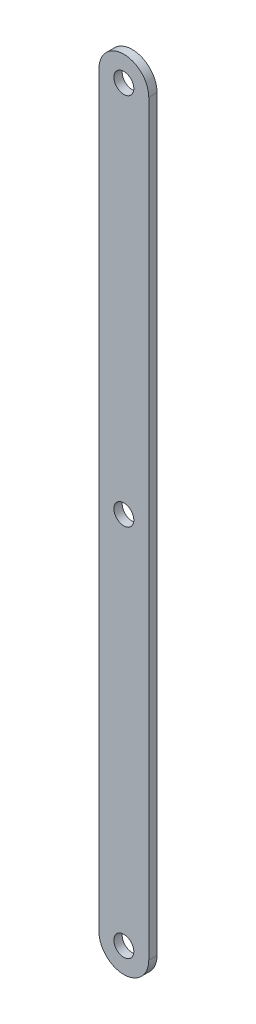
ISO-10303-21;
HEADER;
FILE_DESCRIPTION(('STEP AP214'),'2;1');
FILE_NAME('part.step','',(''),(''),'','','');
FILE_SCHEMA(('AUTOMOTIVE_DESIGN { 1 0 10303 214 1 1 1 1 }'));
ENDSEC;
DATA;
#1=APPLICATION_CONTEXT('core data for automotive mechanical design processes');
#2=APPLICATION_PROTOCOL_DEFINITION('international standard','automotive_design',2000,#1);
#3=PRODUCT_CONTEXT('',#1,'mechanical');
#4=PRODUCT('Part','Part','',(#3));
#5=PRODUCT_RELATED_PRODUCT_CATEGORY('part','',(#4));
#6=PRODUCT_DEFINITION_FORMATION('','',#4);
#7=PRODUCT_DEFINITION_CONTEXT('part definition',#1,'design');
#8=PRODUCT_DEFINITION('design','',#6,#7);
#9=PRODUCT_DEFINITION_SHAPE('','',#8);
#10=(LENGTH_UNIT() NAMED_UNIT(*) SI_UNIT(.MILLI.,.METRE.));
#11=(NAMED_UNIT(*) PLANE_ANGLE_UNIT() SI_UNIT($,.RADIAN.));
#12=(NAMED_UNIT(*) SI_UNIT($,.STERADIAN.) SOLID_ANGLE_UNIT());
#13=UNCERTAINTY_MEASURE_WITH_UNIT(LENGTH_MEASURE(1.E-05),#10,'distance_accuracy_value','');
#14=(GEOMETRIC_REPRESENTATION_CONTEXT(3) GLOBAL_UNCERTAINTY_ASSIGNED_CONTEXT((#13)) GLOBAL_UNIT_ASSIGNED_CONTEXT((#10,
#11,#12)) REPRESENTATION_CONTEXT('',''));
#15=CARTESIAN_POINT('',(0.,0.,0.));
#16=DIRECTION('',(0.,0.,1.));
#17=DIRECTION('',(1.,0.,0.));
#18=AXIS2_PLACEMENT_3D('',#15,#16,#17);
#19=CARTESIAN_POINT('',(23.3631138751007,62.6957680311895,5.));
#20=DIRECTION('',(0.,0.,1.));
#21=DIRECTION('',(1.,0.,0.));
#22=AXIS2_PLACEMENT_3D('',#19,#20,#21);
#23=PLANE('',#22);
#24=CARTESIAN_POINT('',(23.3631138751007,62.6957680311895,5.));
#25=DIRECTION('',(0.,0.,1.));
#26=DIRECTION('',(1.,0.,0.));
#27=AXIS2_PLACEMENT_3D('',#24,#25,#26);
#28=CIRCLE('',#27,6.);
#29=CARTESIAN_POINT('',(29.3631138751007,62.6957680311895,5.));
#30=VERTEX_POINT('',#29);
#31=EDGE_CURVE('E115',#30,#30,#28,.T.);
#32=ORIENTED_EDGE('',*,*,#31,.F.);
#33=EDGE_LOOP('',(#32));
#34=FACE_BOUND('',#33,.T.);
#35=CARTESIAN_POINT('',(23.3631138751007,62.6957680311895,5.));
#36=DIRECTION('',(0.,0.,1.));
#37=DIRECTION('',(1.,0.,0.));
#38=AXIS2_PLACEMENT_3D('',#35,#36,#37);
#39=CIRCLE('',#38,15.);
#40=CARTESIAN_POINT('',(8.36311387510069,62.6957680311895,5.));
#41=VERTEX_POINT('',#40);
#42=CARTESIAN_POINT('',(38.3631138751007,62.6957680311895,5.));
#43=VERTEX_POINT('',#42);
#44=EDGE_CURVE('E85',#41,#43,#39,.T.);
#45=ORIENTED_EDGE('',*,*,#44,.T.);
#46=DIRECTION('',(0.,1.,0.));
#47=VECTOR('',#46,1.);
#48=CARTESIAN_POINT('',(38.3631138751007,512.69576803119,5.));
#49=LINE('',#48,#47);
#50=CARTESIAN_POINT('',(38.3631138751007,512.69576803119,5.));
#51=VERTEX_POINT('',#50);
#52=EDGE_CURVE('E80',#43,#51,#49,.T.);
#53=ORIENTED_EDGE('',*,*,#52,.T.);
#54=CARTESIAN_POINT('',(23.3631138751007,512.69576803119,5.));
#55=DIRECTION('',(0.,0.,1.));
#56=DIRECTION('',(1.,0.,0.));
#57=AXIS2_PLACEMENT_3D('',#54,#55,#56);
#58=CIRCLE('',#57,15.);
#59=CARTESIAN_POINT('',(8.36311387510069,512.69576803119,5.));
#60=VERTEX_POINT('',#59);
#61=EDGE_CURVE('E83',#51,#60,#58,.T.);
#62=ORIENTED_EDGE('',*,*,#61,.T.);
#63=DIRECTION('',(0.,-1.,0.));
#64=VECTOR('',#63,1.);
#65=CARTESIAN_POINT('',(8.36311387510069,62.6957680311895,5.));
#66=LINE('',#65,#64);
#67=EDGE_CURVE('E50',#60,#41,#66,.T.);
#68=ORIENTED_EDGE('',*,*,#67,.T.);
#69=EDGE_LOOP('',(#45,#53,#62,#68));
#70=FACE_BOUND('',#69,.T.);
#71=CARTESIAN_POINT('',(23.3631138751007,512.69576803119,5.));
#72=DIRECTION('',(0.,0.,1.));
#73=DIRECTION('',(1.,0.,0.));
#74=AXIS2_PLACEMENT_3D('',#71,#72,#73);
#75=CIRCLE('',#74,6.);
#76=CARTESIAN_POINT('',(29.3631138751007,512.69576803119,5.));
#77=VERTEX_POINT('',#76);
#78=EDGE_CURVE('E100',#77,#77,#75,.T.);
#79=ORIENTED_EDGE('',*,*,#78,.F.);
#80=EDGE_LOOP('',(#79));
#81=FACE_BOUND('',#80,.T.);
#82=CARTESIAN_POINT('',(23.3631138751007,287.69576803119,5.));
#83=DIRECTION('',(0.,0.,1.));
#84=DIRECTION('',(1.,0.,0.));
#85=AXIS2_PLACEMENT_3D('',#82,#83,#84);
#86=CIRCLE('',#85,6.);
#87=CARTESIAN_POINT('',(29.3631138751007,287.69576803119,5.));
#88=VERTEX_POINT('',#87);
#89=EDGE_CURVE('E121',#88,#88,#86,.T.);
#90=ORIENTED_EDGE('',*,*,#89,.F.);
#91=EDGE_LOOP('',(#90));
#92=FACE_BOUND('',#91,.T.);
#93=ADVANCED_FACE('F33',(#34,#70,#81,#92),#23,.T.);
#94=CARTESIAN_POINT('',(23.3631138751007,62.6957680311895,0.));
#95=DIRECTION('',(0.,0.,1.));
#96=DIRECTION('',(1.,0.,0.));
#97=AXIS2_PLACEMENT_3D('',#94,#95,#96);
#98=PLANE('',#97);
#99=CARTESIAN_POINT('',(23.3631138751007,62.6957680311895,0.));
#100=DIRECTION('',(0.,0.,1.));
#101=DIRECTION('',(1.,0.,0.));
#102=AXIS2_PLACEMENT_3D('',#99,#100,#101);
#103=CIRCLE('',#102,15.);
#104=CARTESIAN_POINT('',(8.36311387510069,62.6957680311895,0.));
#105=VERTEX_POINT('',#104);
#106=CARTESIAN_POINT('',(38.3631138751007,62.6957680311895,0.));
#107=VERTEX_POINT('',#106);
#108=EDGE_CURVE('E97',#105,#107,#103,.T.);
#109=ORIENTED_EDGE('',*,*,#108,.F.);
#110=DIRECTION('',(0.,-1.,0.));
#111=VECTOR('',#110,1.);
#112=CARTESIAN_POINT('',(8.36311387510069,62.6957680311895,0.));
#113=LINE('',#112,#111);
#114=CARTESIAN_POINT('',(8.36311387510069,512.69576803119,0.));
#115=VERTEX_POINT('',#114);
#116=EDGE_CURVE('E73',#115,#105,#113,.T.);
#117=ORIENTED_EDGE('',*,*,#116,.F.);
#118=CARTESIAN_POINT('',(23.3631138751007,512.69576803119,0.));
#119=DIRECTION('',(0.,0.,1.));
#120=DIRECTION('',(1.,0.,0.));
#121=AXIS2_PLACEMENT_3D('',#118,#119,#120);
#122=CIRCLE('',#121,15.);
#123=CARTESIAN_POINT('',(38.3631138751007,512.69576803119,0.));
#124=VERTEX_POINT('',#123);
#125=EDGE_CURVE('E67',#124,#115,#122,.T.);
#126=ORIENTED_EDGE('',*,*,#125,.F.);
#127=DIRECTION('',(0.,1.,0.));
#128=VECTOR('',#127,1.);
#129=CARTESIAN_POINT('',(38.3631138751007,512.69576803119,0.));
#130=LINE('',#129,#128);
#131=EDGE_CURVE('E89',#107,#124,#130,.T.);
#132=ORIENTED_EDGE('',*,*,#131,.F.);
#133=EDGE_LOOP('',(#109,#117,#126,#132));
#134=FACE_BOUND('',#133,.T.);
#135=CARTESIAN_POINT('',(23.3631138751007,512.69576803119,0.));
#136=DIRECTION('',(0.,0.,1.));
#137=DIRECTION('',(1.,0.,0.));
#138=AXIS2_PLACEMENT_3D('',#135,#136,#137);
#139=CIRCLE('',#138,6.);
#140=CARTESIAN_POINT('',(29.3631138751007,512.69576803119,0.));
#141=VERTEX_POINT('',#140);
#142=EDGE_CURVE('E112',#141,#141,#139,.T.);
#143=ORIENTED_EDGE('',*,*,#142,.T.);
#144=EDGE_LOOP('',(#143));
#145=FACE_BOUND('',#144,.T.);
#146=CARTESIAN_POINT('',(23.3631138751007,62.6957680311895,0.));
#147=DIRECTION('',(0.,0.,1.));
#148=DIRECTION('',(1.,0.,0.));
#149=AXIS2_PLACEMENT_3D('',#146,#147,#148);
#150=CIRCLE('',#149,6.);
#151=CARTESIAN_POINT('',(29.3631138751007,62.6957680311895,0.));
#152=VERTEX_POINT('',#151);
#153=EDGE_CURVE('E118',#152,#152,#150,.T.);
#154=ORIENTED_EDGE('',*,*,#153,.T.);
#155=EDGE_LOOP('',(#154));
#156=FACE_BOUND('',#155,.T.);
#157=CARTESIAN_POINT('',(23.3631138751007,287.69576803119,0.));
#158=DIRECTION('',(0.,0.,1.));
#159=DIRECTION('',(1.,0.,0.));
#160=AXIS2_PLACEMENT_3D('',#157,#158,#159);
#161=CIRCLE('',#160,6.);
#162=CARTESIAN_POINT('',(29.3631138751007,287.69576803119,0.));
#163=VERTEX_POINT('',#162);
#164=EDGE_CURVE('E124',#163,#163,#161,.T.);
#165=ORIENTED_EDGE('',*,*,#164,.T.);
#166=EDGE_LOOP('',(#165));
#167=FACE_BOUND('',#166,.T.);
#168=ADVANCED_FACE('F108',(#134,#145,#156,#167),#98,.F.);
#169=CARTESIAN_POINT('',(23.3631138751007,62.6957680311895,5.));
#170=DIRECTION('',(0.,0.,-1.));
#171=DIRECTION('',(-1.,0.,0.));
#172=AXIS2_PLACEMENT_3D('',#169,#170,#171);
#173=CYLINDRICAL_SURFACE('',#172,15.);
#174=ORIENTED_EDGE('',*,*,#108,.T.);
#175=DIRECTION('',(0.,0.,-1.));
#176=VECTOR('',#175,1.);
#177=CARTESIAN_POINT('',(38.3631138751007,62.6957680311895,5.));
#178=LINE('',#177,#176);
#179=EDGE_CURVE('E11',#43,#107,#178,.T.);
#180=ORIENTED_EDGE('',*,*,#179,.F.);
#181=ORIENTED_EDGE('',*,*,#44,.F.);
#182=DIRECTION('',(0.,0.,-1.));
#183=VECTOR('',#182,1.);
#184=CARTESIAN_POINT('',(8.36311387510069,62.6957680311895,5.));
#185=LINE('',#184,#183);
#186=EDGE_CURVE('E93',#41,#105,#185,.T.);
#187=ORIENTED_EDGE('',*,*,#186,.T.);
#188=EDGE_LOOP('',(#174,#180,#181,#187));
#189=FACE_BOUND('',#188,.T.);
#190=ADVANCED_FACE('F35',(#189),#173,.T.);
#191=CARTESIAN_POINT('',(38.3631138751007,512.69576803119,5.));
#192=DIRECTION('',(-1.,0.,0.));
#193=DIRECTION('',(0.,-1.,0.));
#194=AXIS2_PLACEMENT_3D('',#191,#192,#193);
#195=PLANE('',#194);
#196=ORIENTED_EDGE('',*,*,#131,.T.);
#197=DIRECTION('',(0.,0.,-1.));
#198=VECTOR('',#197,1.);
#199=CARTESIAN_POINT('',(38.3631138751007,512.69576803119,5.));
#200=LINE('',#199,#198);
#201=EDGE_CURVE('E42',#51,#124,#200,.T.);
#202=ORIENTED_EDGE('',*,*,#201,.F.);
#203=ORIENTED_EDGE('',*,*,#52,.F.);
#204=ORIENTED_EDGE('',*,*,#179,.T.);
#205=EDGE_LOOP('',(#196,#202,#203,#204));
#206=FACE_BOUND('',#205,.T.);
#207=ADVANCED_FACE('F88',(#206),#195,.F.);
#208=CARTESIAN_POINT('',(23.3631138751007,512.69576803119,5.));
#209=DIRECTION('',(0.,0.,-1.));
#210=DIRECTION('',(-1.,0.,0.));
#211=AXIS2_PLACEMENT_3D('',#208,#209,#210);
#212=CYLINDRICAL_SURFACE('',#211,15.);
#213=ORIENTED_EDGE('',*,*,#125,.T.);
#214=DIRECTION('',(0.,0.,-1.));
#215=VECTOR('',#214,1.);
#216=CARTESIAN_POINT('',(8.36311387510069,512.69576803119,5.));
#217=LINE('',#216,#215);
#218=EDGE_CURVE('E90',#60,#115,#217,.T.);
#219=ORIENTED_EDGE('',*,*,#218,.F.);
#220=ORIENTED_EDGE('',*,*,#61,.F.);
#221=ORIENTED_EDGE('',*,*,#201,.T.);
#222=EDGE_LOOP('',(#213,#219,#220,#221));
#223=FACE_BOUND('',#222,.T.);
#224=ADVANCED_FACE('F91',(#223),#212,.T.);
#225=CARTESIAN_POINT('',(8.36311387510069,62.6957680311895,5.));
#226=DIRECTION('',(1.,0.,0.));
#227=DIRECTION('',(0.,0.,-1.));
#228=AXIS2_PLACEMENT_3D('',#225,#226,#227);
#229=PLANE('',#228);
#230=ORIENTED_EDGE('',*,*,#116,.T.);
#231=ORIENTED_EDGE('',*,*,#186,.F.);
#232=ORIENTED_EDGE('',*,*,#67,.F.);
#233=ORIENTED_EDGE('',*,*,#218,.T.);
#234=EDGE_LOOP('',(#230,#231,#232,#233));
#235=FACE_BOUND('',#234,.T.);
#236=ADVANCED_FACE('F105',(#235),#229,.F.);
#237=CARTESIAN_POINT('',(23.3631138751007,512.69576803119,5.));
#238=DIRECTION('',(0.,0.,-1.));
#239=DIRECTION('',(-1.,0.,0.));
#240=AXIS2_PLACEMENT_3D('',#237,#238,#239);
#241=CYLINDRICAL_SURFACE('',#240,6.);
#242=ORIENTED_EDGE('',*,*,#78,.T.);
#243=EDGE_LOOP('',(#242));
#244=FACE_BOUND('',#243,.T.);
#245=ORIENTED_EDGE('',*,*,#142,.F.);
#246=EDGE_LOOP('',(#245));
#247=FACE_BOUND('',#246,.T.);
#248=ADVANCED_FACE('F142',(#244,#247),#241,.F.);
#249=CARTESIAN_POINT('',(23.3631138751007,62.6957680311895,5.));
#250=DIRECTION('',(0.,0.,-1.));
#251=DIRECTION('',(-1.,0.,0.));
#252=AXIS2_PLACEMENT_3D('',#249,#250,#251);
#253=CYLINDRICAL_SURFACE('',#252,6.);
#254=ORIENTED_EDGE('',*,*,#31,.T.);
#255=EDGE_LOOP('',(#254));
#256=FACE_BOUND('',#255,.T.);
#257=ORIENTED_EDGE('',*,*,#153,.F.);
#258=EDGE_LOOP('',(#257));
#259=FACE_BOUND('',#258,.T.);
#260=ADVANCED_FACE('F188',(#256,#259),#253,.F.);
#261=CARTESIAN_POINT('',(23.3631138751007,287.69576803119,5.));
#262=DIRECTION('',(0.,0.,-1.));
#263=DIRECTION('',(-1.,0.,0.));
#264=AXIS2_PLACEMENT_3D('',#261,#262,#263);
#265=CYLINDRICAL_SURFACE('',#264,6.);
#266=ORIENTED_EDGE('',*,*,#89,.T.);
#267=EDGE_LOOP('',(#266));
#268=FACE_BOUND('',#267,.T.);
#269=ORIENTED_EDGE('',*,*,#164,.F.);
#270=EDGE_LOOP('',(#269));
#271=FACE_BOUND('',#270,.T.);
#272=ADVANCED_FACE('F130',(#268,#271),#265,.F.);
#273=CLOSED_SHELL('',(#93,#168,#190,#207,#224,#236,#248,#260,#272));
#274=MANIFOLD_SOLID_BREP('B2',#273);
#275=ADVANCED_BREP_SHAPE_REPRESENTATION('',(#18,#274),#14);
#276=SHAPE_DEFINITION_REPRESENTATION(#9,#275);
ENDSEC;
END-ISO-10303-21;
